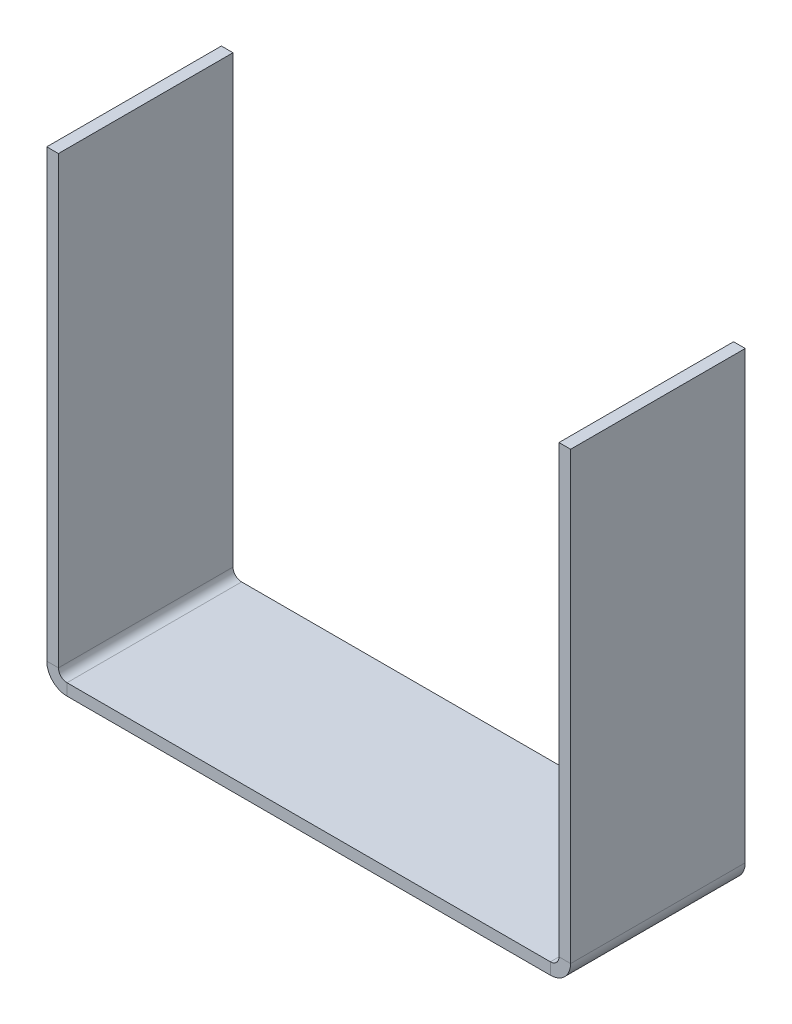
ISO-10303-21;
HEADER;
FILE_DESCRIPTION(('STEP AP214'),'2;1');
FILE_NAME('part.step','',(''),(''),'','','');
FILE_SCHEMA(('AUTOMOTIVE_DESIGN { 1 0 10303 214 1 1 1 1 }'));
ENDSEC;
DATA;
#1=APPLICATION_CONTEXT('core data for automotive mechanical design processes');
#2=APPLICATION_PROTOCOL_DEFINITION('international standard','automotive_design',2000,#1);
#3=PRODUCT_CONTEXT('',#1,'mechanical');
#4=PRODUCT('Part','Part','',(#3));
#5=PRODUCT_RELATED_PRODUCT_CATEGORY('part','',(#4));
#6=PRODUCT_DEFINITION_FORMATION('','',#4);
#7=PRODUCT_DEFINITION_CONTEXT('part definition',#1,'design');
#8=PRODUCT_DEFINITION('design','',#6,#7);
#9=PRODUCT_DEFINITION_SHAPE('','',#8);
#10=(LENGTH_UNIT() NAMED_UNIT(*) SI_UNIT(.MILLI.,.METRE.));
#11=(NAMED_UNIT(*) PLANE_ANGLE_UNIT() SI_UNIT($,.RADIAN.));
#12=(NAMED_UNIT(*) SI_UNIT($,.STERADIAN.) SOLID_ANGLE_UNIT());
#13=UNCERTAINTY_MEASURE_WITH_UNIT(LENGTH_MEASURE(1.E-05),#10,'distance_accuracy_value','');
#14=(GEOMETRIC_REPRESENTATION_CONTEXT(3) GLOBAL_UNCERTAINTY_ASSIGNED_CONTEXT((#13)) GLOBAL_UNIT_ASSIGNED_CONTEXT((#10,
#11,#12)) REPRESENTATION_CONTEXT('',''));
#15=CARTESIAN_POINT('',(0.,0.,0.));
#16=DIRECTION('',(0.,0.,1.));
#17=DIRECTION('',(1.,0.,0.));
#18=AXIS2_PLACEMENT_3D('',#15,#16,#17);
#19=CARTESIAN_POINT('',(0.,-1.,0.));
#20=DIRECTION('',(0.,-1.,0.));
#21=DIRECTION('',(0.,0.,-1.));
#22=AXIS2_PLACEMENT_3D('',#19,#20,#21);
#23=PLANE('',#22);
#24=DIRECTION('',(-1.,0.,0.));
#25=VECTOR('',#24,1.);
#26=CARTESIAN_POINT('',(0.,-1.,-15.));
#27=LINE('',#26,#25);
#28=CARTESIAN_POINT('',(43.2634,-0.999999999999997,-15.));
#29=VERTEX_POINT('',#28);
#30=CARTESIAN_POINT('',(1.7366,-1.,-15.));
#31=VERTEX_POINT('',#30);
#32=EDGE_CURVE('E13',#29,#31,#27,.T.);
#33=ORIENTED_EDGE('',*,*,#32,.F.);
#34=DIRECTION('',(0.,0.,-1.));
#35=VECTOR('',#34,1.);
#36=CARTESIAN_POINT('',(43.2634,-0.999999999999997,-15.));
#37=LINE('',#36,#35);
#38=CARTESIAN_POINT('',(43.2634,-1.,0.));
#39=VERTEX_POINT('',#38);
#40=EDGE_CURVE('E324',#29,#39,#37,.F.);
#41=ORIENTED_EDGE('',*,*,#40,.T.);
#42=DIRECTION('',(1.,0.,0.));
#43=VECTOR('',#42,1.);
#44=CARTESIAN_POINT('',(0.,-1.,0.));
#45=LINE('',#44,#43);
#46=CARTESIAN_POINT('',(1.7366,-1.,0.));
#47=VERTEX_POINT('',#46);
#48=EDGE_CURVE('E85',#47,#39,#45,.T.);
#49=ORIENTED_EDGE('',*,*,#48,.F.);
#50=DIRECTION('',(0.,0.,1.));
#51=VECTOR('',#50,1.);
#52=CARTESIAN_POINT('',(1.7366,-1.,0.));
#53=LINE('',#52,#51);
#54=EDGE_CURVE('E99',#47,#31,#53,.F.);
#55=ORIENTED_EDGE('',*,*,#54,.T.);
#56=EDGE_LOOP('',(#33,#41,#49,#55));
#57=FACE_BOUND('',#56,.T.);
#58=ADVANCED_FACE('F76',(#57),#23,.T.);
#59=CARTESIAN_POINT('',(0.,0.,0.));
#60=DIRECTION('',(0.,-1.,0.));
#61=DIRECTION('',(0.,0.,-1.));
#62=AXIS2_PLACEMENT_3D('',#59,#60,#61);
#63=PLANE('',#62);
#64=DIRECTION('',(0.,0.,-1.));
#65=VECTOR('',#64,1.);
#66=CARTESIAN_POINT('',(43.2634,0.,-15.));
#67=LINE('',#66,#65);
#68=CARTESIAN_POINT('',(43.2634,0.,-15.));
#69=VERTEX_POINT('',#68);
#70=CARTESIAN_POINT('',(43.2634,0.,0.));
#71=VERTEX_POINT('',#70);
#72=EDGE_CURVE('E196',#69,#71,#67,.F.);
#73=ORIENTED_EDGE('',*,*,#72,.F.);
#74=DIRECTION('',(-1.,0.,0.));
#75=VECTOR('',#74,1.);
#76=CARTESIAN_POINT('',(0.,0.,-15.));
#77=LINE('',#76,#75);
#78=CARTESIAN_POINT('',(1.7366,0.,-15.));
#79=VERTEX_POINT('',#78);
#80=EDGE_CURVE('E80',#69,#79,#77,.T.);
#81=ORIENTED_EDGE('',*,*,#80,.T.);
#82=DIRECTION('',(0.,0.,1.));
#83=VECTOR('',#82,1.);
#84=CARTESIAN_POINT('',(1.7366,0.,0.));
#85=LINE('',#84,#83);
#86=CARTESIAN_POINT('',(1.7366,0.,0.));
#87=VERTEX_POINT('',#86);
#88=EDGE_CURVE('E143',#87,#79,#85,.F.);
#89=ORIENTED_EDGE('',*,*,#88,.F.);
#90=DIRECTION('',(1.,0.,0.));
#91=VECTOR('',#90,1.);
#92=CARTESIAN_POINT('',(0.,0.,0.));
#93=LINE('',#92,#91);
#94=EDGE_CURVE('E184',#87,#71,#93,.T.);
#95=ORIENTED_EDGE('',*,*,#94,.T.);
#96=EDGE_LOOP('',(#73,#81,#89,#95));
#97=FACE_BOUND('',#96,.T.);
#98=ADVANCED_FACE('F193',(#97),#63,.F.);
#99=CARTESIAN_POINT('',(0.,-1.,-15.));
#100=DIRECTION('',(0.,0.,-1.));
#101=DIRECTION('',(-1.,0.,0.));
#102=AXIS2_PLACEMENT_3D('',#99,#100,#101);
#103=PLANE('',#102);
#104=ORIENTED_EDGE('',*,*,#80,.F.);
#105=DIRECTION('',(0.,-1.,0.));
#106=VECTOR('',#105,1.);
#107=CARTESIAN_POINT('',(43.2634,0.,-15.));
#108=LINE('',#107,#106);
#109=EDGE_CURVE('E330',#69,#29,#108,.T.);
#110=ORIENTED_EDGE('',*,*,#109,.T.);
#111=ORIENTED_EDGE('',*,*,#32,.T.);
#112=DIRECTION('',(0.,-1.,0.));
#113=VECTOR('',#112,1.);
#114=CARTESIAN_POINT('',(1.7366,0.,-15.));
#115=LINE('',#114,#113);
#116=EDGE_CURVE('E181',#79,#31,#115,.T.);
#117=ORIENTED_EDGE('',*,*,#116,.F.);
#118=EDGE_LOOP('',(#104,#110,#111,#117));
#119=FACE_BOUND('',#118,.T.);
#120=ADVANCED_FACE('F199',(#119),#103,.T.);
#121=CARTESIAN_POINT('',(0.,-1.,0.));
#122=DIRECTION('',(0.,0.,1.));
#123=DIRECTION('',(1.,0.,0.));
#124=AXIS2_PLACEMENT_3D('',#121,#122,#123);
#125=PLANE('',#124);
#126=DIRECTION('',(0.,-1.,0.));
#127=VECTOR('',#126,1.);
#128=CARTESIAN_POINT('',(43.2634,0.,0.));
#129=LINE('',#128,#127);
#130=EDGE_CURVE('E172',#71,#39,#129,.T.);
#131=ORIENTED_EDGE('',*,*,#130,.F.);
#132=ORIENTED_EDGE('',*,*,#94,.F.);
#133=DIRECTION('',(0.,-1.,0.));
#134=VECTOR('',#133,1.);
#135=CARTESIAN_POINT('',(1.7366,0.,0.));
#136=LINE('',#135,#134);
#137=EDGE_CURVE('E142',#87,#47,#136,.T.);
#138=ORIENTED_EDGE('',*,*,#137,.T.);
#139=ORIENTED_EDGE('',*,*,#48,.T.);
#140=EDGE_LOOP('',(#131,#132,#138,#139));
#141=FACE_BOUND('',#140,.T.);
#142=ADVANCED_FACE('F78',(#141),#125,.T.);
#143=CARTESIAN_POINT('',(1.7366,0.7366,-15.));
#144=DIRECTION('',(0.,0.,-1.));
#145=DIRECTION('',(-1.,0.,0.));
#146=AXIS2_PLACEMENT_3D('',#143,#144,#145);
#147=PLANE('',#146);
#148=DIRECTION('',(1.,0.,0.));
#149=VECTOR('',#148,1.);
#150=CARTESIAN_POINT('',(0.,0.736599999999994,-15.));
#151=LINE('',#150,#149);
#152=CARTESIAN_POINT('',(0.999999999999997,0.736599999999997,-15.));
#153=VERTEX_POINT('',#152);
#154=CARTESIAN_POINT('',(0.,0.736599999999994,-15.));
#155=VERTEX_POINT('',#154);
#156=EDGE_CURVE('E133',#153,#155,#151,.F.);
#157=ORIENTED_EDGE('',*,*,#156,.F.);
#158=CARTESIAN_POINT('',(1.7366,0.7366,-15.));
#159=DIRECTION('',(0.,0.,1.));
#160=DIRECTION('',(1.,0.,0.));
#161=AXIS2_PLACEMENT_3D('',#158,#159,#160);
#162=CIRCLE('',#161,0.7366);
#163=EDGE_CURVE('E127',#79,#153,#162,.F.);
#164=ORIENTED_EDGE('',*,*,#163,.F.);
#165=ORIENTED_EDGE('',*,*,#116,.T.);
#166=CARTESIAN_POINT('',(1.7366,0.7366,-15.));
#167=DIRECTION('',(0.,0.,1.));
#168=DIRECTION('',(1.,0.,0.));
#169=AXIS2_PLACEMENT_3D('',#166,#167,#168);
#170=CIRCLE('',#169,1.7366);
#171=EDGE_CURVE('E174',#31,#155,#170,.F.);
#172=ORIENTED_EDGE('',*,*,#171,.T.);
#173=EDGE_LOOP('',(#157,#164,#165,#172));
#174=FACE_BOUND('',#173,.T.);
#175=ADVANCED_FACE('F198',(#174),#147,.T.);
#176=CARTESIAN_POINT('',(1.7366,0.7366,0.));
#177=DIRECTION('',(0.,0.,-1.));
#178=DIRECTION('',(-1.,0.,0.));
#179=AXIS2_PLACEMENT_3D('',#176,#177,#178);
#180=PLANE('',#179);
#181=CARTESIAN_POINT('',(1.7366,0.7366,0.));
#182=DIRECTION('',(0.,0.,1.));
#183=DIRECTION('',(1.,0.,0.));
#184=AXIS2_PLACEMENT_3D('',#181,#182,#183);
#185=CIRCLE('',#184,0.7366);
#186=CARTESIAN_POINT('',(0.999999999999997,0.736599999999997,0.));
#187=VERTEX_POINT('',#186);
#188=EDGE_CURVE('E124',#187,#87,#185,.T.);
#189=ORIENTED_EDGE('',*,*,#188,.F.);
#190=DIRECTION('',(1.,0.,0.));
#191=VECTOR('',#190,1.);
#192=CARTESIAN_POINT('',(0.999999999999997,0.736599999999997,0.));
#193=LINE('',#192,#191);
#194=CARTESIAN_POINT('',(0.,0.736599999999994,0.));
#195=VERTEX_POINT('',#194);
#196=EDGE_CURVE('E132',#187,#195,#193,.F.);
#197=ORIENTED_EDGE('',*,*,#196,.T.);
#198=CARTESIAN_POINT('',(1.7366,0.7366,0.));
#199=DIRECTION('',(0.,0.,1.));
#200=DIRECTION('',(1.,0.,0.));
#201=AXIS2_PLACEMENT_3D('',#198,#199,#200);
#202=CIRCLE('',#201,1.7366);
#203=EDGE_CURVE('E175',#195,#47,#202,.T.);
#204=ORIENTED_EDGE('',*,*,#203,.T.);
#205=ORIENTED_EDGE('',*,*,#137,.F.);
#206=EDGE_LOOP('',(#189,#197,#204,#205));
#207=FACE_BOUND('',#206,.T.);
#208=ADVANCED_FACE('F138',(#207),#180,.F.);
#209=CARTESIAN_POINT('',(1.7366,0.7366,0.));
#210=DIRECTION('',(0.,0.,1.));
#211=DIRECTION('',(-1.,0.,0.));
#212=AXIS2_PLACEMENT_3D('',#209,#210,#211);
#213=CYLINDRICAL_SURFACE('',#212,1.7366);
#214=ORIENTED_EDGE('',*,*,#54,.F.);
#215=ORIENTED_EDGE('',*,*,#203,.F.);
#216=DIRECTION('',(0.,0.,1.));
#217=VECTOR('',#216,1.);
#218=CARTESIAN_POINT('',(0.,0.736599999999994,-15.));
#219=LINE('',#218,#217);
#220=EDGE_CURVE('E156',#195,#155,#219,.F.);
#221=ORIENTED_EDGE('',*,*,#220,.T.);
#222=ORIENTED_EDGE('',*,*,#171,.F.);
#223=EDGE_LOOP('',(#214,#215,#221,#222));
#224=FACE_BOUND('',#223,.T.);
#225=ADVANCED_FACE('F215',(#224),#213,.T.);
#226=CARTESIAN_POINT('',(1.7366,0.7366,0.));
#227=DIRECTION('',(0.,0.,1.));
#228=DIRECTION('',(-1.,0.,0.));
#229=AXIS2_PLACEMENT_3D('',#226,#227,#228);
#230=CYLINDRICAL_SURFACE('',#229,0.7366);
#231=ORIENTED_EDGE('',*,*,#88,.T.);
#232=ORIENTED_EDGE('',*,*,#163,.T.);
#233=DIRECTION('',(0.,0.,1.));
#234=VECTOR('',#233,1.);
#235=CARTESIAN_POINT('',(0.999999999999997,0.736599999999997,-15.));
#236=LINE('',#235,#234);
#237=EDGE_CURVE('E120',#153,#187,#236,.T.);
#238=ORIENTED_EDGE('',*,*,#237,.T.);
#239=ORIENTED_EDGE('',*,*,#188,.T.);
#240=EDGE_LOOP('',(#231,#232,#238,#239));
#241=FACE_BOUND('',#240,.T.);
#242=ADVANCED_FACE('F123',(#241),#230,.F.);
#243=CARTESIAN_POINT('',(0.,0.,-15.));
#244=DIRECTION('',(0.,0.,1.));
#245=DIRECTION('',(1.,0.,0.));
#246=AXIS2_PLACEMENT_3D('',#243,#244,#245);
#247=PLANE('',#246);
#248=ORIENTED_EDGE('',*,*,#156,.T.);
#249=DIRECTION('',(0.,-1.,0.));
#250=VECTOR('',#249,1.);
#251=CARTESIAN_POINT('',(0.,0.,-15.));
#252=LINE('',#251,#250);
#253=CARTESIAN_POINT('',(-1.36167772214882E-13,39.,-15.));
#254=VERTEX_POINT('',#253);
#255=EDGE_CURVE('E164',#254,#155,#252,.T.);
#256=ORIENTED_EDGE('',*,*,#255,.F.);
#257=DIRECTION('',(1.,0.,0.));
#258=VECTOR('',#257,1.);
#259=CARTESIAN_POINT('',(-1.36167772214882E-13,39.,-15.));
#260=LINE('',#259,#258);
#261=CARTESIAN_POINT('',(0.999999999999864,39.,-15.));
#262=VERTEX_POINT('',#261);
#263=EDGE_CURVE('E344',#254,#262,#260,.T.);
#264=ORIENTED_EDGE('',*,*,#263,.T.);
#265=DIRECTION('',(0.,1.,0.));
#266=VECTOR('',#265,1.);
#267=CARTESIAN_POINT('',(1.,0.,-15.));
#268=LINE('',#267,#266);
#269=EDGE_CURVE('E162',#262,#153,#268,.F.);
#270=ORIENTED_EDGE('',*,*,#269,.T.);
#271=EDGE_LOOP('',(#248,#256,#264,#270));
#272=FACE_BOUND('',#271,.T.);
#273=ADVANCED_FACE('F220',(#272),#247,.F.);
#274=CARTESIAN_POINT('',(-1.36175792864179E-13,39.,0.));
#275=DIRECTION('',(0.,0.,-1.));
#276=DIRECTION('',(-1.,0.,0.));
#277=AXIS2_PLACEMENT_3D('',#274,#275,#276);
#278=PLANE('',#277);
#279=ORIENTED_EDGE('',*,*,#196,.F.);
#280=DIRECTION('',(0.,-1.,0.));
#281=VECTOR('',#280,1.);
#282=CARTESIAN_POINT('',(0.999999999999864,39.,0.));
#283=LINE('',#282,#281);
#284=CARTESIAN_POINT('',(0.999999999999864,39.,0.));
#285=VERTEX_POINT('',#284);
#286=EDGE_CURVE('E152',#187,#285,#283,.F.);
#287=ORIENTED_EDGE('',*,*,#286,.T.);
#288=DIRECTION('',(1.,0.,0.));
#289=VECTOR('',#288,1.);
#290=CARTESIAN_POINT('',(-1.36175792864179E-13,39.,0.));
#291=LINE('',#290,#289);
#292=CARTESIAN_POINT('',(-1.36167772214882E-13,39.,0.));
#293=VERTEX_POINT('',#292);
#294=EDGE_CURVE('E144',#293,#285,#291,.T.);
#295=ORIENTED_EDGE('',*,*,#294,.F.);
#296=DIRECTION('',(0.,1.,0.));
#297=VECTOR('',#296,1.);
#298=CARTESIAN_POINT('',(0.,0.,0.));
#299=LINE('',#298,#297);
#300=EDGE_CURVE('E155',#195,#293,#299,.T.);
#301=ORIENTED_EDGE('',*,*,#300,.F.);
#302=EDGE_LOOP('',(#279,#287,#295,#301));
#303=FACE_BOUND('',#302,.T.);
#304=ADVANCED_FACE('F149',(#303),#278,.F.);
#305=CARTESIAN_POINT('',(0.,0.,0.));
#306=DIRECTION('',(1.,0.,0.));
#307=DIRECTION('',(0.,1.,0.));
#308=AXIS2_PLACEMENT_3D('',#305,#306,#307);
#309=PLANE('',#308);
#310=ORIENTED_EDGE('',*,*,#220,.F.);
#311=ORIENTED_EDGE('',*,*,#300,.T.);
#312=DIRECTION('',(0.,0.,-1.));
#313=VECTOR('',#312,1.);
#314=CARTESIAN_POINT('',(-1.36167772214882E-13,39.,0.));
#315=LINE('',#314,#313);
#316=EDGE_CURVE('E347',#293,#254,#315,.T.);
#317=ORIENTED_EDGE('',*,*,#316,.T.);
#318=ORIENTED_EDGE('',*,*,#255,.T.);
#319=EDGE_LOOP('',(#310,#311,#317,#318));
#320=FACE_BOUND('',#319,.T.);
#321=ADVANCED_FACE('F228',(#320),#309,.F.);
#322=CARTESIAN_POINT('',(1.,0.,0.));
#323=DIRECTION('',(1.,0.,0.));
#324=DIRECTION('',(0.,1.,0.));
#325=AXIS2_PLACEMENT_3D('',#322,#323,#324);
#326=PLANE('',#325);
#327=ORIENTED_EDGE('',*,*,#286,.F.);
#328=ORIENTED_EDGE('',*,*,#237,.F.);
#329=ORIENTED_EDGE('',*,*,#269,.F.);
#330=DIRECTION('',(0.,0.,1.));
#331=VECTOR('',#330,1.);
#332=CARTESIAN_POINT('',(0.999999999999864,39.,-15.));
#333=LINE('',#332,#331);
#334=EDGE_CURVE('E161',#285,#262,#333,.F.);
#335=ORIENTED_EDGE('',*,*,#334,.F.);
#336=EDGE_LOOP('',(#327,#328,#329,#335));
#337=FACE_BOUND('',#336,.T.);
#338=ADVANCED_FACE('F159',(#337),#326,.T.);
#339=CARTESIAN_POINT('',(-1.36175792864179E-13,39.,-15.));
#340=DIRECTION('',(0.,-1.,0.));
#341=DIRECTION('',(1.,0.,0.));
#342=AXIS2_PLACEMENT_3D('',#339,#340,#341);
#343=PLANE('',#342);
#344=ORIENTED_EDGE('',*,*,#334,.T.);
#345=ORIENTED_EDGE('',*,*,#263,.F.);
#346=ORIENTED_EDGE('',*,*,#316,.F.);
#347=ORIENTED_EDGE('',*,*,#294,.T.);
#348=EDGE_LOOP('',(#344,#345,#346,#347));
#349=FACE_BOUND('',#348,.T.);
#350=ADVANCED_FACE('F229',(#349),#343,.F.);
#351=CARTESIAN_POINT('',(43.2634,0.7366,0.));
#352=DIRECTION('',(0.,0.,1.));
#353=DIRECTION('',(1.,0.,0.));
#354=AXIS2_PLACEMENT_3D('',#351,#352,#353);
#355=PLANE('',#354);
#356=DIRECTION('',(-1.,0.,0.));
#357=VECTOR('',#356,1.);
#358=CARTESIAN_POINT('',(45.,0.736599999999993,0.));
#359=LINE('',#358,#357);
#360=CARTESIAN_POINT('',(44.,0.736599999999997,0.));
#361=VERTEX_POINT('',#360);
#362=CARTESIAN_POINT('',(45.,0.736599999999993,0.));
#363=VERTEX_POINT('',#362);
#364=EDGE_CURVE('E321',#361,#363,#359,.F.);
#365=ORIENTED_EDGE('',*,*,#364,.F.);
#366=CARTESIAN_POINT('',(43.2634,0.7366,0.));
#367=DIRECTION('',(0.,0.,-1.));
#368=DIRECTION('',(-1.,0.,0.));
#369=AXIS2_PLACEMENT_3D('',#366,#367,#368);
#370=CIRCLE('',#369,0.736599999999997);
#371=EDGE_CURVE('E333',#71,#361,#370,.F.);
#372=ORIENTED_EDGE('',*,*,#371,.F.);
#373=ORIENTED_EDGE('',*,*,#130,.T.);
#374=CARTESIAN_POINT('',(43.2634,0.7366,0.));
#375=DIRECTION('',(0.,0.,-1.));
#376=DIRECTION('',(-1.,0.,0.));
#377=AXIS2_PLACEMENT_3D('',#374,#375,#376);
#378=CIRCLE('',#377,1.7366);
#379=EDGE_CURVE('E327',#39,#363,#378,.F.);
#380=ORIENTED_EDGE('',*,*,#379,.T.);
#381=EDGE_LOOP('',(#365,#372,#373,#380));
#382=FACE_BOUND('',#381,.T.);
#383=ADVANCED_FACE('F232',(#382),#355,.T.);
#384=CARTESIAN_POINT('',(43.2634,0.7366,-15.));
#385=DIRECTION('',(0.,0.,1.));
#386=DIRECTION('',(1.,0.,0.));
#387=AXIS2_PLACEMENT_3D('',#384,#385,#386);
#388=PLANE('',#387);
#389=CARTESIAN_POINT('',(43.2634,0.7366,-15.));
#390=DIRECTION('',(0.,0.,-1.));
#391=DIRECTION('',(-1.,0.,0.));
#392=AXIS2_PLACEMENT_3D('',#389,#390,#391);
#393=CIRCLE('',#392,0.736599999999997);
#394=CARTESIAN_POINT('',(44.,0.736599999999997,-15.));
#395=VERTEX_POINT('',#394);
#396=EDGE_CURVE('E337',#395,#69,#393,.T.);
#397=ORIENTED_EDGE('',*,*,#396,.F.);
#398=DIRECTION('',(-1.,0.,0.));
#399=VECTOR('',#398,1.);
#400=CARTESIAN_POINT('',(44.,0.736599999999997,-15.));
#401=LINE('',#400,#399);
#402=CARTESIAN_POINT('',(45.,0.736599999999993,-15.));
#403=VERTEX_POINT('',#402);
#404=EDGE_CURVE('E295',#395,#403,#401,.F.);
#405=ORIENTED_EDGE('',*,*,#404,.T.);
#406=CARTESIAN_POINT('',(43.2634,0.7366,-15.));
#407=DIRECTION('',(0.,0.,-1.));
#408=DIRECTION('',(-1.,0.,0.));
#409=AXIS2_PLACEMENT_3D('',#406,#407,#408);
#410=CIRCLE('',#409,1.7366);
#411=EDGE_CURVE('E328',#403,#29,#410,.T.);
#412=ORIENTED_EDGE('',*,*,#411,.T.);
#413=ORIENTED_EDGE('',*,*,#109,.F.);
#414=EDGE_LOOP('',(#397,#405,#412,#413));
#415=FACE_BOUND('',#414,.T.);
#416=ADVANCED_FACE('F239',(#415),#388,.F.);
#417=CARTESIAN_POINT('',(43.2634,0.7366,-15.));
#418=DIRECTION('',(0.,0.,-1.));
#419=DIRECTION('',(1.,0.,0.));
#420=AXIS2_PLACEMENT_3D('',#417,#418,#419);
#421=CYLINDRICAL_SURFACE('',#420,1.7366);
#422=ORIENTED_EDGE('',*,*,#40,.F.);
#423=ORIENTED_EDGE('',*,*,#411,.F.);
#424=DIRECTION('',(0.,0.,-1.));
#425=VECTOR('',#424,1.);
#426=CARTESIAN_POINT('',(45.,0.736599999999993,0.));
#427=LINE('',#426,#425);
#428=EDGE_CURVE('E280',#403,#363,#427,.F.);
#429=ORIENTED_EDGE('',*,*,#428,.T.);
#430=ORIENTED_EDGE('',*,*,#379,.F.);
#431=EDGE_LOOP('',(#422,#423,#429,#430));
#432=FACE_BOUND('',#431,.T.);
#433=ADVANCED_FACE('F242',(#432),#421,.T.);
#434=CARTESIAN_POINT('',(43.2634,0.7366,-15.));
#435=DIRECTION('',(0.,0.,-1.));
#436=DIRECTION('',(1.,0.,0.));
#437=AXIS2_PLACEMENT_3D('',#434,#435,#436);
#438=CYLINDRICAL_SURFACE('',#437,0.736599999999997);
#439=ORIENTED_EDGE('',*,*,#72,.T.);
#440=ORIENTED_EDGE('',*,*,#371,.T.);
#441=DIRECTION('',(0.,0.,-1.));
#442=VECTOR('',#441,1.);
#443=CARTESIAN_POINT('',(44.,0.736599999999997,0.));
#444=LINE('',#443,#442);
#445=EDGE_CURVE('E318',#361,#395,#444,.T.);
#446=ORIENTED_EDGE('',*,*,#445,.T.);
#447=ORIENTED_EDGE('',*,*,#396,.T.);
#448=EDGE_LOOP('',(#439,#440,#446,#447));
#449=FACE_BOUND('',#448,.T.);
#450=ADVANCED_FACE('F247',(#449),#438,.F.);
#451=CARTESIAN_POINT('',(45.0000000000001,39.,-15.));
#452=DIRECTION('',(0.,0.,1.));
#453=DIRECTION('',(1.,0.,0.));
#454=AXIS2_PLACEMENT_3D('',#451,#452,#453);
#455=PLANE('',#454);
#456=ORIENTED_EDGE('',*,*,#404,.F.);
#457=DIRECTION('',(0.,-1.,0.));
#458=VECTOR('',#457,1.);
#459=CARTESIAN_POINT('',(44.0000000000001,39.,-15.));
#460=LINE('',#459,#458);
#461=CARTESIAN_POINT('',(44.0000000000001,39.,-15.));
#462=VERTEX_POINT('',#461);
#463=EDGE_CURVE('E294',#395,#462,#460,.F.);
#464=ORIENTED_EDGE('',*,*,#463,.T.);
#465=DIRECTION('',(-1.,0.,0.));
#466=VECTOR('',#465,1.);
#467=CARTESIAN_POINT('',(45.0000000000001,39.,-15.));
#468=LINE('',#467,#466);
#469=CARTESIAN_POINT('',(45.0000000000001,39.,-15.));
#470=VERTEX_POINT('',#469);
#471=EDGE_CURVE('E303',#470,#462,#468,.T.);
#472=ORIENTED_EDGE('',*,*,#471,.F.);
#473=DIRECTION('',(0.,1.,0.));
#474=VECTOR('',#473,1.);
#475=CARTESIAN_POINT('',(45.,-1.63619802198241E-13,-15.));
#476=LINE('',#475,#474);
#477=EDGE_CURVE('E284',#403,#470,#476,.T.);
#478=ORIENTED_EDGE('',*,*,#477,.F.);
#479=EDGE_LOOP('',(#456,#464,#472,#478));
#480=FACE_BOUND('',#479,.T.);
#481=ADVANCED_FACE('F250',(#480),#455,.F.);
#482=CARTESIAN_POINT('',(45.,0.,0.));
#483=DIRECTION('',(0.,0.,-1.));
#484=DIRECTION('',(-1.,0.,0.));
#485=AXIS2_PLACEMENT_3D('',#482,#483,#484);
#486=PLANE('',#485);
#487=ORIENTED_EDGE('',*,*,#364,.T.);
#488=DIRECTION('',(0.,-1.,0.));
#489=VECTOR('',#488,1.);
#490=CARTESIAN_POINT('',(45.,-1.63619802198241E-13,0.));
#491=LINE('',#490,#489);
#492=CARTESIAN_POINT('',(45.0000000000001,39.,0.));
#493=VERTEX_POINT('',#492);
#494=EDGE_CURVE('E288',#493,#363,#491,.T.);
#495=ORIENTED_EDGE('',*,*,#494,.F.);
#496=DIRECTION('',(-1.,0.,0.));
#497=VECTOR('',#496,1.);
#498=CARTESIAN_POINT('',(45.0000000000001,39.,0.));
#499=LINE('',#498,#497);
#500=CARTESIAN_POINT('',(44.0000000000001,39.,0.));
#501=VERTEX_POINT('',#500);
#502=EDGE_CURVE('E383',#493,#501,#499,.T.);
#503=ORIENTED_EDGE('',*,*,#502,.T.);
#504=DIRECTION('',(0.,1.,0.));
#505=VECTOR('',#504,1.);
#506=CARTESIAN_POINT('',(44.,0.,0.));
#507=LINE('',#506,#505);
#508=EDGE_CURVE('E306',#501,#361,#507,.F.);
#509=ORIENTED_EDGE('',*,*,#508,.T.);
#510=EDGE_LOOP('',(#487,#495,#503,#509));
#511=FACE_BOUND('',#510,.T.);
#512=ADVANCED_FACE('F257',(#511),#486,.F.);
#513=CARTESIAN_POINT('',(45.,-1.63619802198241E-13,0.));
#514=DIRECTION('',(-1.,0.,0.));
#515=DIRECTION('',(0.,-1.,0.));
#516=AXIS2_PLACEMENT_3D('',#513,#514,#515);
#517=PLANE('',#516);
#518=ORIENTED_EDGE('',*,*,#428,.F.);
#519=ORIENTED_EDGE('',*,*,#477,.T.);
#520=DIRECTION('',(0.,0.,1.));
#521=VECTOR('',#520,1.);
#522=CARTESIAN_POINT('',(45.0000000000001,39.,0.));
#523=LINE('',#522,#521);
#524=EDGE_CURVE('E305',#470,#493,#523,.T.);
#525=ORIENTED_EDGE('',*,*,#524,.T.);
#526=ORIENTED_EDGE('',*,*,#494,.T.);
#527=EDGE_LOOP('',(#518,#519,#525,#526));
#528=FACE_BOUND('',#527,.T.);
#529=ADVANCED_FACE('F266',(#528),#517,.F.);
#530=CARTESIAN_POINT('',(44.,-1.60128320859398E-13,0.));
#531=DIRECTION('',(-1.,0.,0.));
#532=DIRECTION('',(0.,-1.,0.));
#533=AXIS2_PLACEMENT_3D('',#530,#531,#532);
#534=PLANE('',#533);
#535=ORIENTED_EDGE('',*,*,#463,.F.);
#536=ORIENTED_EDGE('',*,*,#445,.F.);
#537=ORIENTED_EDGE('',*,*,#508,.F.);
#538=DIRECTION('',(0.,0.,-1.));
#539=VECTOR('',#538,1.);
#540=CARTESIAN_POINT('',(44.0000000000001,39.,0.));
#541=LINE('',#540,#539);
#542=EDGE_CURVE('E310',#462,#501,#541,.F.);
#543=ORIENTED_EDGE('',*,*,#542,.F.);
#544=EDGE_LOOP('',(#535,#536,#537,#543));
#545=FACE_BOUND('',#544,.T.);
#546=ADVANCED_FACE('F262',(#545),#534,.T.);
#547=CARTESIAN_POINT('',(45.0000000000001,39.,0.));
#548=DIRECTION('',(0.,-1.,0.));
#549=DIRECTION('',(1.,0.,0.));
#550=AXIS2_PLACEMENT_3D('',#547,#548,#549);
#551=PLANE('',#550);
#552=ORIENTED_EDGE('',*,*,#542,.T.);
#553=ORIENTED_EDGE('',*,*,#502,.F.);
#554=ORIENTED_EDGE('',*,*,#524,.F.);
#555=ORIENTED_EDGE('',*,*,#471,.T.);
#556=EDGE_LOOP('',(#552,#553,#554,#555));
#557=FACE_BOUND('',#556,.T.);
#558=ADVANCED_FACE('F259',(#557),#551,.F.);
#559=CLOSED_SHELL('',(#58,#98,#120,#142,#175,#208,#225,#242,#273,#304,#321,#338,#350,#383,#416,
#433,#450,#481,#512,#529,#546,#558));
#560=MANIFOLD_SOLID_BREP('B2',#559);
#561=ADVANCED_BREP_SHAPE_REPRESENTATION('',(#18,#560),#14);
#562=SHAPE_DEFINITION_REPRESENTATION(#9,#561);
ENDSEC;
END-ISO-10303-21;
